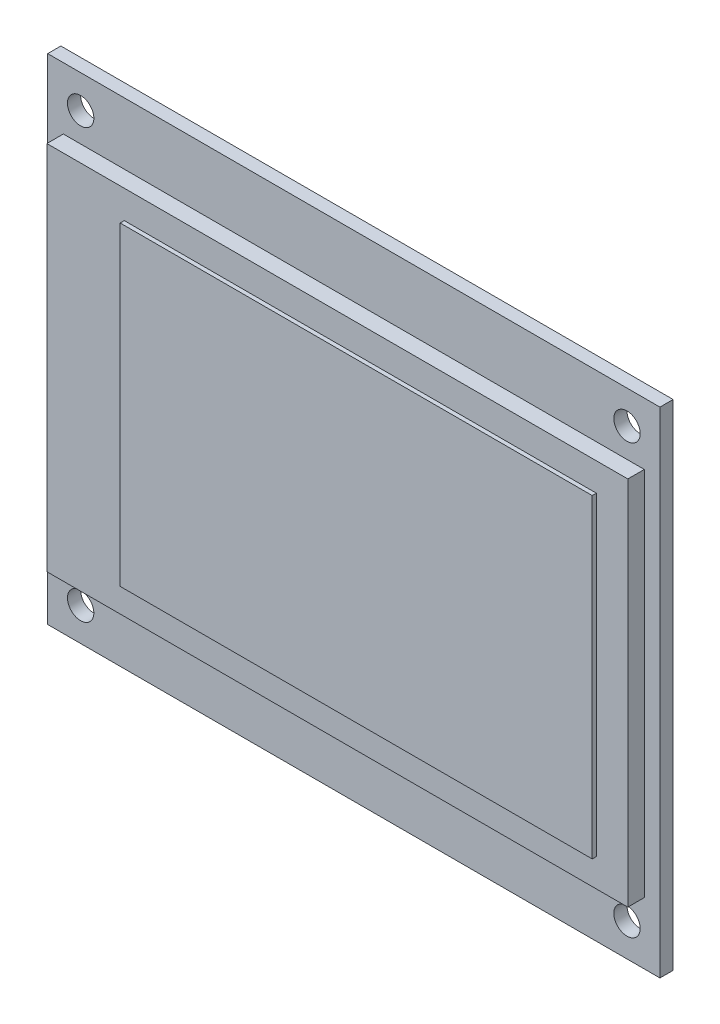
ISO-10303-21;
HEADER;
FILE_DESCRIPTION(('STEP AP214'),'2;1');
FILE_NAME('part.step','',(''),(''),'','','');
FILE_SCHEMA(('AUTOMOTIVE_DESIGN { 1 0 10303 214 1 1 1 1 }'));
ENDSEC;
DATA;
#1=APPLICATION_CONTEXT('core data for automotive mechanical design processes');
#2=APPLICATION_PROTOCOL_DEFINITION('international standard','automotive_design',2000,#1);
#3=PRODUCT_CONTEXT('',#1,'mechanical');
#4=PRODUCT('Part','Part','',(#3));
#5=PRODUCT_RELATED_PRODUCT_CATEGORY('part','',(#4));
#6=PRODUCT_DEFINITION_FORMATION('','',#4);
#7=PRODUCT_DEFINITION_CONTEXT('part definition',#1,'design');
#8=PRODUCT_DEFINITION('design','',#6,#7);
#9=PRODUCT_DEFINITION_SHAPE('','',#8);
#10=(LENGTH_UNIT() NAMED_UNIT(*) SI_UNIT(.MILLI.,.METRE.));
#11=(NAMED_UNIT(*) PLANE_ANGLE_UNIT() SI_UNIT($,.RADIAN.));
#12=(NAMED_UNIT(*) SI_UNIT($,.STERADIAN.) SOLID_ANGLE_UNIT());
#13=UNCERTAINTY_MEASURE_WITH_UNIT(LENGTH_MEASURE(1.E-05),#10,'distance_accuracy_value','');
#14=(GEOMETRIC_REPRESENTATION_CONTEXT(3) GLOBAL_UNCERTAINTY_ASSIGNED_CONTEXT((#13)) GLOBAL_UNIT_ASSIGNED_CONTEXT((#10,
#11,#12)) REPRESENTATION_CONTEXT('',''));
#15=CARTESIAN_POINT('',(0.,0.,0.));
#16=DIRECTION('',(0.,0.,1.));
#17=DIRECTION('',(1.,0.,0.));
#18=AXIS2_PLACEMENT_3D('',#15,#16,#17);
#19=CARTESIAN_POINT('',(0.,0.,3.6));
#20=DIRECTION('',(0.,0.,1.));
#21=DIRECTION('',(1.,0.,0.));
#22=AXIS2_PLACEMENT_3D('',#19,#20,#21);
#23=PLANE('',#22);
#24=DIRECTION('',(0.,-1.,0.));
#25=VECTOR('',#24,1.);
#26=CARTESIAN_POINT('',(1.9,52.5,3.6));
#27=LINE('',#26,#25);
#28=CARTESIAN_POINT('',(1.9,52.5,3.6));
#29=VERTEX_POINT('',#28);
#30=CARTESIAN_POINT('',(1.90000000000001,7.5,3.6));
#31=VERTEX_POINT('',#30);
#32=EDGE_CURVE('E176',#29,#31,#27,.T.);
#33=ORIENTED_EDGE('',*,*,#32,.T.);
#34=DIRECTION('',(1.,0.,0.));
#35=VECTOR('',#34,1.);
#36=CARTESIAN_POINT('',(1.90000000000001,7.5,3.6));
#37=LINE('',#36,#35);
#38=CARTESIAN_POINT('',(72.4,7.5,3.6));
#39=VERTEX_POINT('',#38);
#40=EDGE_CURVE('E179',#31,#39,#37,.T.);
#41=ORIENTED_EDGE('',*,*,#40,.T.);
#42=DIRECTION('',(0.,1.,0.));
#43=VECTOR('',#42,1.);
#44=CARTESIAN_POINT('',(72.4,52.5,3.6));
#45=LINE('',#44,#43);
#46=CARTESIAN_POINT('',(72.4,52.5,3.6));
#47=VERTEX_POINT('',#46);
#48=EDGE_CURVE('E182',#39,#47,#45,.T.);
#49=ORIENTED_EDGE('',*,*,#48,.T.);
#50=DIRECTION('',(-1.,0.,0.));
#51=VECTOR('',#50,1.);
#52=CARTESIAN_POINT('',(1.9,52.5,3.6));
#53=LINE('',#52,#51);
#54=EDGE_CURVE('E184',#47,#29,#53,.T.);
#55=ORIENTED_EDGE('',*,*,#54,.T.);
#56=EDGE_LOOP('',(#33,#41,#49,#55));
#57=FACE_BOUND('',#56,.T.);
#58=DIRECTION('',(1.,0.,0.));
#59=VECTOR('',#58,1.);
#60=CARTESIAN_POINT('',(11.292,10.904,3.6));
#61=LINE('',#60,#59);
#62=CARTESIAN_POINT('',(11.292,10.904,3.6));
#63=VERTEX_POINT('',#62);
#64=CARTESIAN_POINT('',(68.58,10.904,3.6));
#65=VERTEX_POINT('',#64);
#66=EDGE_CURVE('E350',#63,#65,#61,.T.);
#67=ORIENTED_EDGE('',*,*,#66,.F.);
#68=DIRECTION('',(0.,-1.,0.));
#69=VECTOR('',#68,1.);
#70=CARTESIAN_POINT('',(11.292,49.096,3.6));
#71=LINE('',#70,#69);
#72=CARTESIAN_POINT('',(11.292,49.096,3.6));
#73=VERTEX_POINT('',#72);
#74=EDGE_CURVE('E168',#73,#63,#71,.T.);
#75=ORIENTED_EDGE('',*,*,#74,.F.);
#76=DIRECTION('',(-1.,0.,0.));
#77=VECTOR('',#76,1.);
#78=CARTESIAN_POINT('',(11.292,49.096,3.6));
#79=LINE('',#78,#77);
#80=CARTESIAN_POINT('',(68.58,49.096,3.6));
#81=VERTEX_POINT('',#80);
#82=EDGE_CURVE('E164',#81,#73,#79,.T.);
#83=ORIENTED_EDGE('',*,*,#82,.F.);
#84=DIRECTION('',(0.,1.,0.));
#85=VECTOR('',#84,1.);
#86=CARTESIAN_POINT('',(68.58,49.096,3.6));
#87=LINE('',#86,#85);
#88=EDGE_CURVE('E352',#65,#81,#87,.T.);
#89=ORIENTED_EDGE('',*,*,#88,.F.);
#90=EDGE_LOOP('',(#67,#75,#83,#89));
#91=FACE_BOUND('',#90,.T.);
#92=ADVANCED_FACE('F32',(#57,#91),#23,.T.);
#93=CARTESIAN_POINT('',(0.,0.,1.6));
#94=DIRECTION('',(0.,0.,-1.));
#95=DIRECTION('',(-1.,0.,0.));
#96=AXIS2_PLACEMENT_3D('',#93,#94,#95);
#97=PLANE('',#96);
#98=CARTESIAN_POINT('',(4.,4.,1.6));
#99=DIRECTION('',(0.,0.,1.));
#100=DIRECTION('',(1.,0.,0.));
#101=AXIS2_PLACEMENT_3D('',#98,#99,#100);
#102=CIRCLE('',#101,1.59999999999999);
#103=CARTESIAN_POINT('',(5.6,4.,1.6));
#104=VERTEX_POINT('',#103);
#105=EDGE_CURVE('E226',#104,#104,#102,.T.);
#106=ORIENTED_EDGE('',*,*,#105,.F.);
#107=EDGE_LOOP('',(#106));
#108=FACE_BOUND('',#107,.T.);
#109=CARTESIAN_POINT('',(70.3,4.,1.6));
#110=DIRECTION('',(0.,0.,1.));
#111=DIRECTION('',(1.,0.,0.));
#112=AXIS2_PLACEMENT_3D('',#109,#110,#111);
#113=CIRCLE('',#112,1.59999999999999);
#114=CARTESIAN_POINT('',(71.9,4.,1.6));
#115=VERTEX_POINT('',#114);
#116=EDGE_CURVE('E277',#115,#115,#113,.T.);
#117=ORIENTED_EDGE('',*,*,#116,.F.);
#118=EDGE_LOOP('',(#117));
#119=FACE_BOUND('',#118,.T.);
#120=CARTESIAN_POINT('',(70.3,56.,1.6));
#121=DIRECTION('',(0.,0.,1.));
#122=DIRECTION('',(1.,0.,0.));
#123=AXIS2_PLACEMENT_3D('',#120,#121,#122);
#124=CIRCLE('',#123,1.59999999999999);
#125=CARTESIAN_POINT('',(71.9,56.,1.6));
#126=VERTEX_POINT('',#125);
#127=EDGE_CURVE('E278',#126,#126,#124,.T.);
#128=ORIENTED_EDGE('',*,*,#127,.F.);
#129=EDGE_LOOP('',(#128));
#130=FACE_BOUND('',#129,.T.);
#131=CARTESIAN_POINT('',(4.,56.,1.6));
#132=DIRECTION('',(0.,0.,1.));
#133=DIRECTION('',(1.,0.,0.));
#134=AXIS2_PLACEMENT_3D('',#131,#132,#133);
#135=CIRCLE('',#134,1.59999999999999);
#136=CARTESIAN_POINT('',(5.59999999999999,56.,1.6));
#137=VERTEX_POINT('',#136);
#138=EDGE_CURVE('E203',#137,#137,#135,.T.);
#139=ORIENTED_EDGE('',*,*,#138,.F.);
#140=EDGE_LOOP('',(#139));
#141=FACE_BOUND('',#140,.T.);
#142=DIRECTION('',(0.,-1.,0.));
#143=VECTOR('',#142,1.);
#144=CARTESIAN_POINT('',(1.9,52.5,1.6));
#145=LINE('',#144,#143);
#146=CARTESIAN_POINT('',(1.9,52.5,1.6));
#147=VERTEX_POINT('',#146);
#148=CARTESIAN_POINT('',(1.9,22.5,1.6));
#149=VERTEX_POINT('',#148);
#150=EDGE_CURVE('E57',#147,#149,#145,.T.);
#151=ORIENTED_EDGE('',*,*,#150,.F.);
#152=DIRECTION('',(-1.,0.,0.));
#153=VECTOR('',#152,1.);
#154=CARTESIAN_POINT('',(1.9,52.5,1.6));
#155=LINE('',#154,#153);
#156=CARTESIAN_POINT('',(72.4,52.5,1.6));
#157=VERTEX_POINT('',#156);
#158=EDGE_CURVE('E180',#157,#147,#155,.T.);
#159=ORIENTED_EDGE('',*,*,#158,.F.);
#160=DIRECTION('',(0.,1.,0.));
#161=VECTOR('',#160,1.);
#162=CARTESIAN_POINT('',(72.4,52.5,1.6));
#163=LINE('',#162,#161);
#164=CARTESIAN_POINT('',(72.4,7.5,1.6));
#165=VERTEX_POINT('',#164);
#166=EDGE_CURVE('E189',#165,#157,#163,.T.);
#167=ORIENTED_EDGE('',*,*,#166,.F.);
#168=DIRECTION('',(1.,0.,0.));
#169=VECTOR('',#168,1.);
#170=CARTESIAN_POINT('',(1.90000000000001,7.5,1.6));
#171=LINE('',#170,#169);
#172=CARTESIAN_POINT('',(1.9,7.5,1.6));
#173=VERTEX_POINT('',#172);
#174=EDGE_CURVE('E171',#173,#165,#171,.T.);
#175=ORIENTED_EDGE('',*,*,#174,.F.);
#176=DIRECTION('',(1.,0.,0.));
#177=VECTOR('',#176,1.);
#178=CARTESIAN_POINT('',(1.9,7.5,1.6));
#179=LINE('',#178,#177);
#180=CARTESIAN_POINT('',(0.,7.5,1.6));
#181=VERTEX_POINT('',#180);
#182=EDGE_CURVE('E218',#181,#173,#179,.T.);
#183=ORIENTED_EDGE('',*,*,#182,.F.);
#184=DIRECTION('',(0.,-1.,0.));
#185=VECTOR('',#184,1.);
#186=CARTESIAN_POINT('',(0.,0.,1.6));
#187=LINE('',#186,#185);
#188=CARTESIAN_POINT('',(0.,0.,1.6));
#189=VERTEX_POINT('',#188);
#190=EDGE_CURVE('E253',#181,#189,#187,.T.);
#191=ORIENTED_EDGE('',*,*,#190,.T.);
#192=DIRECTION('',(1.,0.,0.));
#193=VECTOR('',#192,1.);
#194=CARTESIAN_POINT('',(0.,0.,1.6));
#195=LINE('',#194,#193);
#196=CARTESIAN_POINT('',(74.3,0.,1.6));
#197=VERTEX_POINT('',#196);
#198=EDGE_CURVE('E252',#189,#197,#195,.T.);
#199=ORIENTED_EDGE('',*,*,#198,.T.);
#200=DIRECTION('',(0.,1.,0.));
#201=VECTOR('',#200,1.);
#202=CARTESIAN_POINT('',(74.3,0.,1.6));
#203=LINE('',#202,#201);
#204=CARTESIAN_POINT('',(74.3,60.,1.6));
#205=VERTEX_POINT('',#204);
#206=EDGE_CURVE('E255',#197,#205,#203,.T.);
#207=ORIENTED_EDGE('',*,*,#206,.T.);
#208=DIRECTION('',(-1.,0.,0.));
#209=VECTOR('',#208,1.);
#210=CARTESIAN_POINT('',(0.,60.,1.6));
#211=LINE('',#210,#209);
#212=CARTESIAN_POINT('',(0.,60.,1.6));
#213=VERTEX_POINT('',#212);
#214=EDGE_CURVE('E257',#205,#213,#211,.T.);
#215=ORIENTED_EDGE('',*,*,#214,.T.);
#216=CARTESIAN_POINT('',(0.,22.5,1.6));
#217=VERTEX_POINT('',#216);
#218=EDGE_CURVE('E249',#213,#217,#187,.T.);
#219=ORIENTED_EDGE('',*,*,#218,.T.);
#220=DIRECTION('',(-1.,0.,0.));
#221=VECTOR('',#220,1.);
#222=CARTESIAN_POINT('',(1.9,22.5,1.6));
#223=LINE('',#222,#221);
#224=EDGE_CURVE('E217',#149,#217,#223,.T.);
#225=ORIENTED_EDGE('',*,*,#224,.F.);
#226=EDGE_LOOP('',(#151,#159,#167,#175,#183,#191,#199,#207,#215,#219,#225));
#227=FACE_BOUND('',#226,.T.);
#228=ADVANCED_FACE('F313',(#108,#119,#130,#141,#227),#97,.F.);
#229=CARTESIAN_POINT('',(0.,0.,1.6));
#230=DIRECTION('',(1.,0.,0.));
#231=DIRECTION('',(0.,0.,-1.));
#232=AXIS2_PLACEMENT_3D('',#229,#230,#231);
#233=PLANE('',#232);
#234=ORIENTED_EDGE('',*,*,#190,.F.);
#235=DIRECTION('',(0.,0.,1.));
#236=VECTOR('',#235,1.);
#237=CARTESIAN_POINT('',(0.,7.5,0.));
#238=LINE('',#237,#236);
#239=CARTESIAN_POINT('',(0.,7.5,0.));
#240=VERTEX_POINT('',#239);
#241=EDGE_CURVE('E246',#240,#181,#238,.T.);
#242=ORIENTED_EDGE('',*,*,#241,.F.);
#243=DIRECTION('',(0.,-1.,0.));
#244=VECTOR('',#243,1.);
#245=CARTESIAN_POINT('',(0.,0.,0.));
#246=LINE('',#245,#244);
#247=CARTESIAN_POINT('',(0.,0.,0.));
#248=VERTEX_POINT('',#247);
#249=EDGE_CURVE('E245',#240,#248,#246,.T.);
#250=ORIENTED_EDGE('',*,*,#249,.T.);
#251=DIRECTION('',(0.,0.,-1.));
#252=VECTOR('',#251,1.);
#253=CARTESIAN_POINT('',(0.,0.,1.6));
#254=LINE('',#253,#252);
#255=EDGE_CURVE('E11',#189,#248,#254,.T.);
#256=ORIENTED_EDGE('',*,*,#255,.F.);
#257=EDGE_LOOP('',(#234,#242,#250,#256));
#258=FACE_BOUND('',#257,.T.);
#259=ADVANCED_FACE('F310',(#258),#233,.F.);
#260=CARTESIAN_POINT('',(0.,60.,0.));
#261=VERTEX_POINT('',#260);
#262=CARTESIAN_POINT('',(0.,22.5,0.));
#263=VERTEX_POINT('',#262);
#264=EDGE_CURVE('E260',#261,#263,#246,.T.);
#265=ORIENTED_EDGE('',*,*,#264,.T.);
#266=DIRECTION('',(0.,0.,1.));
#267=VECTOR('',#266,1.);
#268=CARTESIAN_POINT('',(0.,22.5,0.));
#269=LINE('',#268,#267);
#270=EDGE_CURVE('E214',#263,#217,#269,.T.);
#271=ORIENTED_EDGE('',*,*,#270,.T.);
#272=ORIENTED_EDGE('',*,*,#218,.F.);
#273=DIRECTION('',(0.,0.,-1.));
#274=VECTOR('',#273,1.);
#275=CARTESIAN_POINT('',(0.,60.,1.6));
#276=LINE('',#275,#274);
#277=EDGE_CURVE('E259',#213,#261,#276,.T.);
#278=ORIENTED_EDGE('',*,*,#277,.T.);
#279=EDGE_LOOP('',(#265,#271,#272,#278));
#280=FACE_BOUND('',#279,.T.);
#281=ADVANCED_FACE('F34',(#280),#233,.F.);
#282=CARTESIAN_POINT('',(0.,0.,1.6));
#283=DIRECTION('',(0.,1.,0.));
#284=DIRECTION('',(0.,0.,1.));
#285=AXIS2_PLACEMENT_3D('',#282,#283,#284);
#286=PLANE('',#285);
#287=DIRECTION('',(1.,0.,0.));
#288=VECTOR('',#287,1.);
#289=CARTESIAN_POINT('',(0.,0.,0.));
#290=LINE('',#289,#288);
#291=CARTESIAN_POINT('',(74.3,0.,0.));
#292=VERTEX_POINT('',#291);
#293=EDGE_CURVE('E263',#248,#292,#290,.T.);
#294=ORIENTED_EDGE('',*,*,#293,.T.);
#295=DIRECTION('',(0.,0.,-1.));
#296=VECTOR('',#295,1.);
#297=CARTESIAN_POINT('',(74.3,0.,1.6));
#298=LINE('',#297,#296);
#299=EDGE_CURVE('E41',#197,#292,#298,.T.);
#300=ORIENTED_EDGE('',*,*,#299,.F.);
#301=ORIENTED_EDGE('',*,*,#198,.F.);
#302=ORIENTED_EDGE('',*,*,#255,.T.);
#303=EDGE_LOOP('',(#294,#300,#301,#302));
#304=FACE_BOUND('',#303,.T.);
#305=ADVANCED_FACE('F316',(#304),#286,.F.);
#306=CARTESIAN_POINT('',(74.3,0.,1.6));
#307=DIRECTION('',(-1.,0.,0.));
#308=DIRECTION('',(0.,0.,1.));
#309=AXIS2_PLACEMENT_3D('',#306,#307,#308);
#310=PLANE('',#309);
#311=DIRECTION('',(0.,1.,0.));
#312=VECTOR('',#311,1.);
#313=CARTESIAN_POINT('',(74.3,0.,0.));
#314=LINE('',#313,#312);
#315=CARTESIAN_POINT('',(74.3,60.,0.));
#316=VERTEX_POINT('',#315);
#317=EDGE_CURVE('E265',#292,#316,#314,.T.);
#318=ORIENTED_EDGE('',*,*,#317,.T.);
#319=DIRECTION('',(0.,0.,-1.));
#320=VECTOR('',#319,1.);
#321=CARTESIAN_POINT('',(74.3,60.,1.6));
#322=LINE('',#321,#320);
#323=EDGE_CURVE('E271',#205,#316,#322,.T.);
#324=ORIENTED_EDGE('',*,*,#323,.F.);
#325=ORIENTED_EDGE('',*,*,#206,.F.);
#326=ORIENTED_EDGE('',*,*,#299,.T.);
#327=EDGE_LOOP('',(#318,#324,#325,#326));
#328=FACE_BOUND('',#327,.T.);
#329=ADVANCED_FACE('F321',(#328),#310,.F.);
#330=CARTESIAN_POINT('',(0.,60.,1.6));
#331=DIRECTION('',(0.,-1.,0.));
#332=DIRECTION('',(0.,0.,-1.));
#333=AXIS2_PLACEMENT_3D('',#330,#331,#332);
#334=PLANE('',#333);
#335=DIRECTION('',(-1.,0.,0.));
#336=VECTOR('',#335,1.);
#337=CARTESIAN_POINT('',(0.,60.,0.));
#338=LINE('',#337,#336);
#339=EDGE_CURVE('E267',#316,#261,#338,.T.);
#340=ORIENTED_EDGE('',*,*,#339,.T.);
#341=ORIENTED_EDGE('',*,*,#277,.F.);
#342=ORIENTED_EDGE('',*,*,#214,.F.);
#343=ORIENTED_EDGE('',*,*,#323,.T.);
#344=EDGE_LOOP('',(#340,#341,#342,#343));
#345=FACE_BOUND('',#344,.T.);
#346=ADVANCED_FACE('F297',(#345),#334,.F.);
#347=CARTESIAN_POINT('',(0.,0.,0.));
#348=DIRECTION('',(0.,0.,-1.));
#349=DIRECTION('',(-1.,0.,0.));
#350=AXIS2_PLACEMENT_3D('',#347,#348,#349);
#351=PLANE('',#350);
#352=CARTESIAN_POINT('',(4.,56.,0.));
#353=DIRECTION('',(0.,0.,-1.));
#354=DIRECTION('',(-1.,0.,0.));
#355=AXIS2_PLACEMENT_3D('',#352,#353,#354);
#356=CIRCLE('',#355,1.59999999999999);
#357=CARTESIAN_POINT('',(2.40000000000001,56.,0.));
#358=VERTEX_POINT('',#357);
#359=EDGE_CURVE('E210',#358,#358,#356,.T.);
#360=ORIENTED_EDGE('',*,*,#359,.F.);
#361=EDGE_LOOP('',(#360));
#362=FACE_BOUND('',#361,.T.);
#363=CARTESIAN_POINT('',(70.3,56.,0.));
#364=DIRECTION('',(0.,0.,-1.));
#365=DIRECTION('',(-1.,0.,0.));
#366=AXIS2_PLACEMENT_3D('',#363,#364,#365);
#367=CIRCLE('',#366,1.59999999999999);
#368=CARTESIAN_POINT('',(68.7,56.,0.));
#369=VERTEX_POINT('',#368);
#370=EDGE_CURVE('E275',#369,#369,#367,.T.);
#371=ORIENTED_EDGE('',*,*,#370,.F.);
#372=EDGE_LOOP('',(#371));
#373=FACE_BOUND('',#372,.T.);
#374=CARTESIAN_POINT('',(70.3,4.,0.));
#375=DIRECTION('',(0.,0.,-1.));
#376=DIRECTION('',(-1.,0.,0.));
#377=AXIS2_PLACEMENT_3D('',#374,#375,#376);
#378=CIRCLE('',#377,1.59999999999999);
#379=CARTESIAN_POINT('',(68.7,4.,0.));
#380=VERTEX_POINT('',#379);
#381=EDGE_CURVE('E231',#380,#380,#378,.T.);
#382=ORIENTED_EDGE('',*,*,#381,.F.);
#383=EDGE_LOOP('',(#382));
#384=FACE_BOUND('',#383,.T.);
#385=CARTESIAN_POINT('',(4.,4.,0.));
#386=DIRECTION('',(0.,0.,-1.));
#387=DIRECTION('',(-1.,0.,0.));
#388=AXIS2_PLACEMENT_3D('',#385,#386,#387);
#389=CIRCLE('',#388,1.59999999999999);
#390=CARTESIAN_POINT('',(2.40000000000001,4.,0.));
#391=VERTEX_POINT('',#390);
#392=EDGE_CURVE('E219',#391,#391,#389,.T.);
#393=ORIENTED_EDGE('',*,*,#392,.F.);
#394=EDGE_LOOP('',(#393));
#395=FACE_BOUND('',#394,.T.);
#396=DIRECTION('',(1.,0.,0.));
#397=VECTOR('',#396,1.);
#398=CARTESIAN_POINT('',(1.9,7.5,0.));
#399=LINE('',#398,#397);
#400=CARTESIAN_POINT('',(1.9,7.5,0.));
#401=VERTEX_POINT('',#400);
#402=EDGE_CURVE('E215',#240,#401,#399,.T.);
#403=ORIENTED_EDGE('',*,*,#402,.T.);
#404=DIRECTION('',(0.,1.,0.));
#405=VECTOR('',#404,1.);
#406=CARTESIAN_POINT('',(1.9,22.5,0.));
#407=LINE('',#406,#405);
#408=CARTESIAN_POINT('',(1.9,22.5,0.));
#409=VERTEX_POINT('',#408);
#410=EDGE_CURVE('E223',#401,#409,#407,.T.);
#411=ORIENTED_EDGE('',*,*,#410,.T.);
#412=DIRECTION('',(-1.,0.,0.));
#413=VECTOR('',#412,1.);
#414=CARTESIAN_POINT('',(1.9,22.5,0.));
#415=LINE('',#414,#413);
#416=EDGE_CURVE('E237',#409,#263,#415,.T.);
#417=ORIENTED_EDGE('',*,*,#416,.T.);
#418=ORIENTED_EDGE('',*,*,#264,.F.);
#419=ORIENTED_EDGE('',*,*,#339,.F.);
#420=ORIENTED_EDGE('',*,*,#317,.F.);
#421=ORIENTED_EDGE('',*,*,#293,.F.);
#422=ORIENTED_EDGE('',*,*,#249,.F.);
#423=EDGE_LOOP('',(#403,#411,#417,#418,#419,#420,#421,#422));
#424=FACE_BOUND('',#423,.T.);
#425=ADVANCED_FACE('F293',(#362,#373,#384,#395,#424),#351,.T.);
#426=CARTESIAN_POINT('',(1.9,22.5,0.));
#427=DIRECTION('',(1.,0.,0.));
#428=DIRECTION('',(0.,1.,0.));
#429=AXIS2_PLACEMENT_3D('',#426,#427,#428);
#430=PLANE('',#429);
#431=DIRECTION('',(0.,0.,1.));
#432=VECTOR('',#431,1.);
#433=CARTESIAN_POINT('',(1.9,7.5,0.));
#434=LINE('',#433,#432);
#435=EDGE_CURVE('E242',#401,#173,#434,.T.);
#436=ORIENTED_EDGE('',*,*,#435,.T.);
#437=DIRECTION('',(0.,0.,-1.));
#438=VECTOR('',#437,1.);
#439=CARTESIAN_POINT('',(1.90000000000001,7.5,3.6));
#440=LINE('',#439,#438);
#441=EDGE_CURVE('E201',#31,#173,#440,.T.);
#442=ORIENTED_EDGE('',*,*,#441,.F.);
#443=ORIENTED_EDGE('',*,*,#32,.F.);
#444=DIRECTION('',(0.,0.,-1.));
#445=VECTOR('',#444,1.);
#446=CARTESIAN_POINT('',(1.9,52.5,3.6));
#447=LINE('',#446,#445);
#448=EDGE_CURVE('E186',#29,#147,#447,.T.);
#449=ORIENTED_EDGE('',*,*,#448,.T.);
#450=ORIENTED_EDGE('',*,*,#150,.T.);
#451=DIRECTION('',(0.,0.,1.));
#452=VECTOR('',#451,1.);
#453=CARTESIAN_POINT('',(1.9,22.5,0.));
#454=LINE('',#453,#452);
#455=EDGE_CURVE('E212',#409,#149,#454,.T.);
#456=ORIENTED_EDGE('',*,*,#455,.F.);
#457=ORIENTED_EDGE('',*,*,#410,.F.);
#458=EDGE_LOOP('',(#436,#442,#443,#449,#450,#456,#457));
#459=FACE_BOUND('',#458,.T.);
#460=ADVANCED_FACE('F296',(#459),#430,.F.);
#461=CARTESIAN_POINT('',(1.9,7.5,0.));
#462=DIRECTION('',(0.,-1.,0.));
#463=DIRECTION('',(1.,0.,0.));
#464=AXIS2_PLACEMENT_3D('',#461,#462,#463);
#465=PLANE('',#464);
#466=ORIENTED_EDGE('',*,*,#182,.T.);
#467=ORIENTED_EDGE('',*,*,#435,.F.);
#468=ORIENTED_EDGE('',*,*,#402,.F.);
#469=ORIENTED_EDGE('',*,*,#241,.T.);
#470=EDGE_LOOP('',(#466,#467,#468,#469));
#471=FACE_BOUND('',#470,.T.);
#472=ADVANCED_FACE('F306',(#471),#465,.F.);
#473=CARTESIAN_POINT('',(1.9,22.5,0.));
#474=DIRECTION('',(0.,1.,0.));
#475=DIRECTION('',(0.,0.,1.));
#476=AXIS2_PLACEMENT_3D('',#473,#474,#475);
#477=PLANE('',#476);
#478=ORIENTED_EDGE('',*,*,#224,.T.);
#479=ORIENTED_EDGE('',*,*,#270,.F.);
#480=ORIENTED_EDGE('',*,*,#416,.F.);
#481=ORIENTED_EDGE('',*,*,#455,.T.);
#482=EDGE_LOOP('',(#478,#479,#480,#481));
#483=FACE_BOUND('',#482,.T.);
#484=ADVANCED_FACE('F330',(#483),#477,.F.);
#485=CARTESIAN_POINT('',(4.,4.,1.6));
#486=DIRECTION('',(0.,0.,1.));
#487=DIRECTION('',(1.,0.,0.));
#488=AXIS2_PLACEMENT_3D('',#485,#486,#487);
#489=CYLINDRICAL_SURFACE('',#488,1.59999999999999);
#490=ORIENTED_EDGE('',*,*,#392,.T.);
#491=EDGE_LOOP('',(#490));
#492=FACE_BOUND('',#491,.T.);
#493=ORIENTED_EDGE('',*,*,#105,.T.);
#494=EDGE_LOOP('',(#493));
#495=FACE_BOUND('',#494,.T.);
#496=ADVANCED_FACE('F392',(#492,#495),#489,.F.);
#497=CARTESIAN_POINT('',(70.3,4.,1.6));
#498=DIRECTION('',(0.,0.,1.));
#499=DIRECTION('',(1.,0.,0.));
#500=AXIS2_PLACEMENT_3D('',#497,#498,#499);
#501=CYLINDRICAL_SURFACE('',#500,1.59999999999999);
#502=ORIENTED_EDGE('',*,*,#381,.T.);
#503=EDGE_LOOP('',(#502));
#504=FACE_BOUND('',#503,.T.);
#505=ORIENTED_EDGE('',*,*,#116,.T.);
#506=EDGE_LOOP('',(#505));
#507=FACE_BOUND('',#506,.T.);
#508=ADVANCED_FACE('F290',(#504,#507),#501,.F.);
#509=CARTESIAN_POINT('',(70.3,56.,1.6));
#510=DIRECTION('',(0.,0.,1.));
#511=DIRECTION('',(1.,0.,0.));
#512=AXIS2_PLACEMENT_3D('',#509,#510,#511);
#513=CYLINDRICAL_SURFACE('',#512,1.59999999999999);
#514=ORIENTED_EDGE('',*,*,#370,.T.);
#515=EDGE_LOOP('',(#514));
#516=FACE_BOUND('',#515,.T.);
#517=ORIENTED_EDGE('',*,*,#127,.T.);
#518=EDGE_LOOP('',(#517));
#519=FACE_BOUND('',#518,.T.);
#520=ADVANCED_FACE('F386',(#516,#519),#513,.F.);
#521=CARTESIAN_POINT('',(4.,56.,1.6));
#522=DIRECTION('',(0.,0.,1.));
#523=DIRECTION('',(1.,0.,0.));
#524=AXIS2_PLACEMENT_3D('',#521,#522,#523);
#525=CYLINDRICAL_SURFACE('',#524,1.59999999999999);
#526=ORIENTED_EDGE('',*,*,#359,.T.);
#527=EDGE_LOOP('',(#526));
#528=FACE_BOUND('',#527,.T.);
#529=ORIENTED_EDGE('',*,*,#138,.T.);
#530=EDGE_LOOP('',(#529));
#531=FACE_BOUND('',#530,.T.);
#532=ADVANCED_FACE('F383',(#528,#531),#525,.F.);
#533=CARTESIAN_POINT('',(1.90000000000001,7.5,3.6));
#534=DIRECTION('',(0.,1.,0.));
#535=DIRECTION('',(0.,0.,1.));
#536=AXIS2_PLACEMENT_3D('',#533,#534,#535);
#537=PLANE('',#536);
#538=ORIENTED_EDGE('',*,*,#174,.T.);
#539=DIRECTION('',(0.,0.,-1.));
#540=VECTOR('',#539,1.);
#541=CARTESIAN_POINT('',(72.4,7.5,3.6));
#542=LINE('',#541,#540);
#543=EDGE_CURVE('E198',#39,#165,#542,.T.);
#544=ORIENTED_EDGE('',*,*,#543,.F.);
#545=ORIENTED_EDGE('',*,*,#40,.F.);
#546=ORIENTED_EDGE('',*,*,#441,.T.);
#547=EDGE_LOOP('',(#538,#544,#545,#546));
#548=FACE_BOUND('',#547,.T.);
#549=ADVANCED_FACE('F344',(#548),#537,.F.);
#550=CARTESIAN_POINT('',(72.4,52.5,3.6));
#551=DIRECTION('',(-1.,0.,0.));
#552=DIRECTION('',(0.,0.,1.));
#553=AXIS2_PLACEMENT_3D('',#550,#551,#552);
#554=PLANE('',#553);
#555=ORIENTED_EDGE('',*,*,#166,.T.);
#556=DIRECTION('',(0.,0.,-1.));
#557=VECTOR('',#556,1.);
#558=CARTESIAN_POINT('',(72.4,52.5,3.6));
#559=LINE('',#558,#557);
#560=EDGE_CURVE('E195',#47,#157,#559,.T.);
#561=ORIENTED_EDGE('',*,*,#560,.F.);
#562=ORIENTED_EDGE('',*,*,#48,.F.);
#563=ORIENTED_EDGE('',*,*,#543,.T.);
#564=EDGE_LOOP('',(#555,#561,#562,#563));
#565=FACE_BOUND('',#564,.T.);
#566=ADVANCED_FACE('F340',(#565),#554,.F.);
#567=CARTESIAN_POINT('',(1.9,52.5,3.6));
#568=DIRECTION('',(0.,-1.,0.));
#569=DIRECTION('',(0.,0.,-1.));
#570=AXIS2_PLACEMENT_3D('',#567,#568,#569);
#571=PLANE('',#570);
#572=ORIENTED_EDGE('',*,*,#158,.T.);
#573=ORIENTED_EDGE('',*,*,#448,.F.);
#574=ORIENTED_EDGE('',*,*,#54,.F.);
#575=ORIENTED_EDGE('',*,*,#560,.T.);
#576=EDGE_LOOP('',(#572,#573,#574,#575));
#577=FACE_BOUND('',#576,.T.);
#578=ADVANCED_FACE('F337',(#577),#571,.F.);
#579=CARTESIAN_POINT('',(11.292,49.096,4.1));
#580=DIRECTION('',(1.,0.,0.));
#581=DIRECTION('',(0.,1.,0.));
#582=AXIS2_PLACEMENT_3D('',#579,#580,#581);
#583=PLANE('',#582);
#584=ORIENTED_EDGE('',*,*,#74,.T.);
#585=DIRECTION('',(0.,0.,-1.));
#586=VECTOR('',#585,1.);
#587=CARTESIAN_POINT('',(11.292,10.904,4.1));
#588=LINE('',#587,#586);
#589=CARTESIAN_POINT('',(11.292,10.904,4.1));
#590=VERTEX_POINT('',#589);
#591=EDGE_CURVE('E149',#590,#63,#588,.T.);
#592=ORIENTED_EDGE('',*,*,#591,.F.);
#593=DIRECTION('',(0.,-1.,0.));
#594=VECTOR('',#593,1.);
#595=CARTESIAN_POINT('',(11.292,49.096,4.1));
#596=LINE('',#595,#594);
#597=CARTESIAN_POINT('',(11.292,49.096,4.1));
#598=VERTEX_POINT('',#597);
#599=EDGE_CURVE('E156',#598,#590,#596,.T.);
#600=ORIENTED_EDGE('',*,*,#599,.F.);
#601=DIRECTION('',(0.,0.,-1.));
#602=VECTOR('',#601,1.);
#603=CARTESIAN_POINT('',(11.292,49.096,4.1));
#604=LINE('',#603,#602);
#605=EDGE_CURVE('E359',#598,#73,#604,.T.);
#606=ORIENTED_EDGE('',*,*,#605,.T.);
#607=EDGE_LOOP('',(#584,#592,#600,#606));
#608=FACE_BOUND('',#607,.T.);
#609=ADVANCED_FACE('F166',(#608),#583,.F.);
#610=CARTESIAN_POINT('',(11.292,10.904,4.1));
#611=DIRECTION('',(0.,1.,0.));
#612=DIRECTION('',(0.,0.,1.));
#613=AXIS2_PLACEMENT_3D('',#610,#611,#612);
#614=PLANE('',#613);
#615=ORIENTED_EDGE('',*,*,#66,.T.);
#616=DIRECTION('',(0.,0.,-1.));
#617=VECTOR('',#616,1.);
#618=CARTESIAN_POINT('',(68.58,10.904,4.1));
#619=LINE('',#618,#617);
#620=CARTESIAN_POINT('',(68.58,10.904,4.1));
#621=VERTEX_POINT('',#620);
#622=EDGE_CURVE('E152',#621,#65,#619,.T.);
#623=ORIENTED_EDGE('',*,*,#622,.F.);
#624=DIRECTION('',(1.,0.,0.));
#625=VECTOR('',#624,1.);
#626=CARTESIAN_POINT('',(11.292,10.904,4.1));
#627=LINE('',#626,#625);
#628=EDGE_CURVE('E145',#590,#621,#627,.T.);
#629=ORIENTED_EDGE('',*,*,#628,.F.);
#630=ORIENTED_EDGE('',*,*,#591,.T.);
#631=EDGE_LOOP('',(#615,#623,#629,#630));
#632=FACE_BOUND('',#631,.T.);
#633=ADVANCED_FACE('F147',(#632),#614,.F.);
#634=CARTESIAN_POINT('',(68.58,49.096,4.1));
#635=DIRECTION('',(-1.,0.,0.));
#636=DIRECTION('',(0.,-1.,0.));
#637=AXIS2_PLACEMENT_3D('',#634,#635,#636);
#638=PLANE('',#637);
#639=ORIENTED_EDGE('',*,*,#88,.T.);
#640=DIRECTION('',(0.,0.,-1.));
#641=VECTOR('',#640,1.);
#642=CARTESIAN_POINT('',(68.58,49.096,4.1));
#643=LINE('',#642,#641);
#644=CARTESIAN_POINT('',(68.58,49.096,4.1));
#645=VERTEX_POINT('',#644);
#646=EDGE_CURVE('E49',#645,#81,#643,.T.);
#647=ORIENTED_EDGE('',*,*,#646,.F.);
#648=DIRECTION('',(0.,1.,0.));
#649=VECTOR('',#648,1.);
#650=CARTESIAN_POINT('',(68.58,49.096,4.1));
#651=LINE('',#650,#649);
#652=EDGE_CURVE('E155',#621,#645,#651,.T.);
#653=ORIENTED_EDGE('',*,*,#652,.F.);
#654=ORIENTED_EDGE('',*,*,#622,.T.);
#655=EDGE_LOOP('',(#639,#647,#653,#654));
#656=FACE_BOUND('',#655,.T.);
#657=ADVANCED_FACE('F362',(#656),#638,.F.);
#658=CARTESIAN_POINT('',(11.292,49.096,4.1));
#659=DIRECTION('',(0.,-1.,0.));
#660=DIRECTION('',(0.,0.,-1.));
#661=AXIS2_PLACEMENT_3D('',#658,#659,#660);
#662=PLANE('',#661);
#663=ORIENTED_EDGE('',*,*,#82,.T.);
#664=ORIENTED_EDGE('',*,*,#605,.F.);
#665=DIRECTION('',(-1.,0.,0.));
#666=VECTOR('',#665,1.);
#667=CARTESIAN_POINT('',(11.292,49.096,4.1));
#668=LINE('',#667,#666);
#669=EDGE_CURVE('E160',#645,#598,#668,.T.);
#670=ORIENTED_EDGE('',*,*,#669,.F.);
#671=ORIENTED_EDGE('',*,*,#646,.T.);
#672=EDGE_LOOP('',(#663,#664,#670,#671));
#673=FACE_BOUND('',#672,.T.);
#674=ADVANCED_FACE('F363',(#673),#662,.F.);
#675=CARTESIAN_POINT('',(0.,0.,4.1));
#676=DIRECTION('',(0.,0.,1.));
#677=DIRECTION('',(1.,0.,0.));
#678=AXIS2_PLACEMENT_3D('',#675,#676,#677);
#679=PLANE('',#678);
#680=ORIENTED_EDGE('',*,*,#599,.T.);
#681=ORIENTED_EDGE('',*,*,#628,.T.);
#682=ORIENTED_EDGE('',*,*,#652,.T.);
#683=ORIENTED_EDGE('',*,*,#669,.T.);
#684=EDGE_LOOP('',(#680,#681,#682,#683));
#685=FACE_BOUND('',#684,.T.);
#686=ADVANCED_FACE('F159',(#685),#679,.T.);
#687=CLOSED_SHELL('',(#92,#228,#259,#281,#305,#329,#346,#425,#460,#472,#484,#496,#508,#520,#532,
#549,#566,#578,#609,#633,#657,#674,#686));
#688=MANIFOLD_SOLID_BREP('B2',#687);
#689=ADVANCED_BREP_SHAPE_REPRESENTATION('',(#18,#688),#14);
#690=SHAPE_DEFINITION_REPRESENTATION(#9,#689);
ENDSEC;
END-ISO-10303-21;
